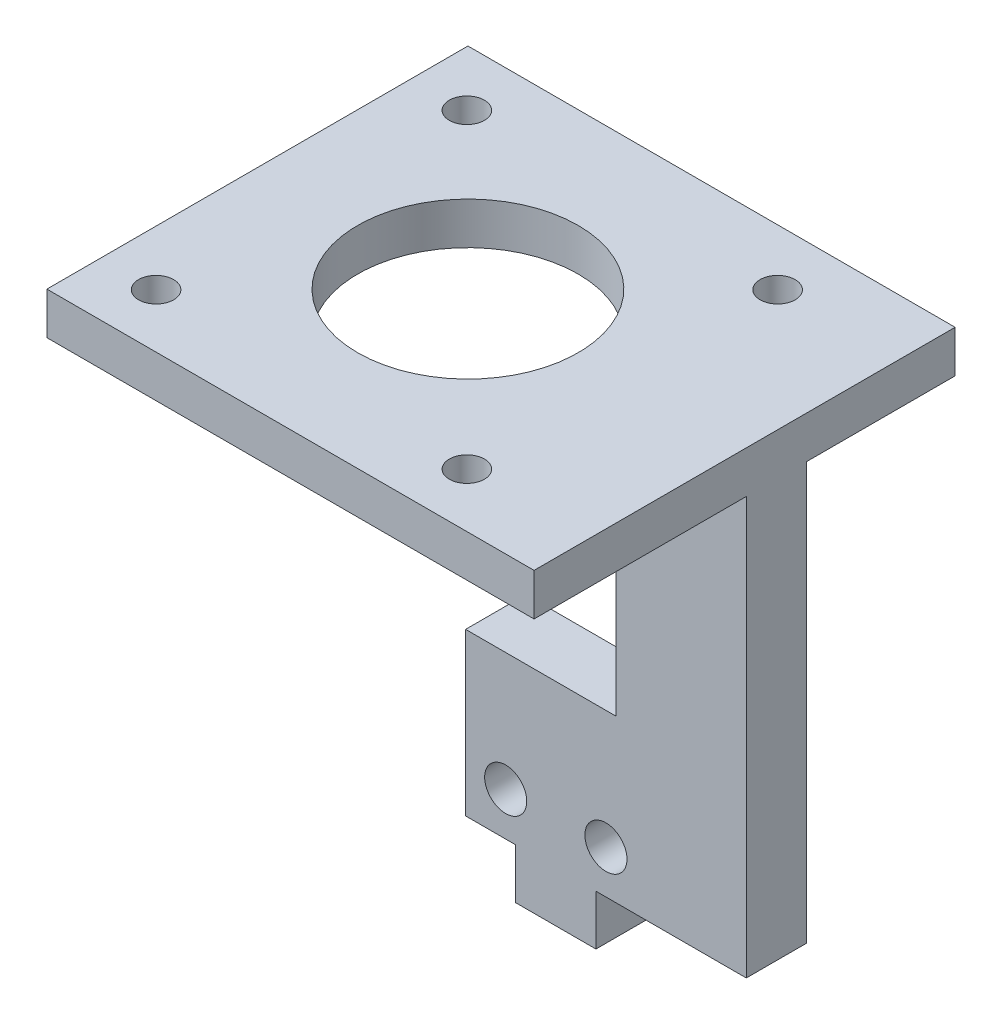
ISO-10303-21;
HEADER;
FILE_DESCRIPTION(('STEP AP214'),'2;1');
FILE_NAME('part.step','',(''),(''),'','','');
FILE_SCHEMA(('AUTOMOTIVE_DESIGN { 1 0 10303 214 1 1 1 1 }'));
ENDSEC;
DATA;
#1=APPLICATION_CONTEXT('core data for automotive mechanical design processes');
#2=APPLICATION_PROTOCOL_DEFINITION('international standard','automotive_design',2000,#1);
#3=PRODUCT_CONTEXT('',#1,'mechanical');
#4=PRODUCT('Part','Part','',(#3));
#5=PRODUCT_RELATED_PRODUCT_CATEGORY('part','',(#4));
#6=PRODUCT_DEFINITION_FORMATION('','',#4);
#7=PRODUCT_DEFINITION_CONTEXT('part definition',#1,'design');
#8=PRODUCT_DEFINITION('design','',#6,#7);
#9=PRODUCT_DEFINITION_SHAPE('','',#8);
#10=(LENGTH_UNIT() NAMED_UNIT(*) SI_UNIT(.MILLI.,.METRE.));
#11=(NAMED_UNIT(*) PLANE_ANGLE_UNIT() SI_UNIT($,.RADIAN.));
#12=(NAMED_UNIT(*) SI_UNIT($,.STERADIAN.) SOLID_ANGLE_UNIT());
#13=UNCERTAINTY_MEASURE_WITH_UNIT(LENGTH_MEASURE(1.E-05),#10,'distance_accuracy_value','');
#14=(GEOMETRIC_REPRESENTATION_CONTEXT(3) GLOBAL_UNCERTAINTY_ASSIGNED_CONTEXT((#13)) GLOBAL_UNIT_ASSIGNED_CONTEXT((#10,
#11,#12)) REPRESENTATION_CONTEXT('',''));
#15=CARTESIAN_POINT('',(0.,0.,0.));
#16=DIRECTION('',(0.,0.,1.));
#17=DIRECTION('',(1.,0.,0.));
#18=AXIS2_PLACEMENT_3D('',#15,#16,#17);
#19=CARTESIAN_POINT('',(0.,0.,6.));
#20=DIRECTION('',(0.,0.,-1.));
#21=DIRECTION('',(-1.,0.,0.));
#22=AXIS2_PLACEMENT_3D('',#19,#20,#21);
#23=PLANE('',#22);
#24=CARTESIAN_POINT('',(14.,4.30447472,6.));
#25=DIRECTION('',(0.,0.,1.));
#26=DIRECTION('',(-1.,0.,0.));
#27=AXIS2_PLACEMENT_3D('',#24,#25,#26);
#28=CIRCLE('',#27,2.1);
#29=CARTESIAN_POINT('',(11.9,4.30447472,6.));
#30=VERTEX_POINT('',#29);
#31=EDGE_CURVE('E229',#30,#30,#28,.T.);
#32=ORIENTED_EDGE('',*,*,#31,.F.);
#33=EDGE_LOOP('',(#32));
#34=FACE_BOUND('',#33,.T.);
#35=CARTESIAN_POINT('',(4.,4.30447472,6.));
#36=DIRECTION('',(0.,0.,1.));
#37=DIRECTION('',(1.,0.,0.));
#38=AXIS2_PLACEMENT_3D('',#35,#36,#37);
#39=CIRCLE('',#38,2.1);
#40=CARTESIAN_POINT('',(6.1,4.30447472,6.));
#41=VERTEX_POINT('',#40);
#42=EDGE_CURVE('E233',#41,#41,#39,.T.);
#43=ORIENTED_EDGE('',*,*,#42,.F.);
#44=EDGE_LOOP('',(#43));
#45=FACE_BOUND('',#44,.T.);
#46=DIRECTION('',(1.,0.,0.));
#47=VECTOR('',#46,1.);
#48=CARTESIAN_POINT('',(0.,41.6,6.));
#49=LINE('',#48,#47);
#50=CARTESIAN_POINT('',(15.,41.6,6.));
#51=VERTEX_POINT('',#50);
#52=CARTESIAN_POINT('',(28.,41.6,6.));
#53=VERTEX_POINT('',#52);
#54=EDGE_CURVE('E176',#51,#53,#49,.T.);
#55=ORIENTED_EDGE('',*,*,#54,.F.);
#56=DIRECTION('',(0.,1.,0.));
#57=VECTOR('',#56,1.);
#58=CARTESIAN_POINT('',(15.,16.1193661254941,6.));
#59=LINE('',#58,#57);
#60=CARTESIAN_POINT('',(15.,16.1193661254941,6.));
#61=VERTEX_POINT('',#60);
#62=EDGE_CURVE('E183',#61,#51,#59,.T.);
#63=ORIENTED_EDGE('',*,*,#62,.F.);
#64=DIRECTION('',(1.,0.,0.));
#65=VECTOR('',#64,1.);
#66=CARTESIAN_POINT('',(0.,16.1193661254941,6.));
#67=LINE('',#66,#65);
#68=CARTESIAN_POINT('',(0.,16.1193661254941,6.));
#69=VERTEX_POINT('',#68);
#70=EDGE_CURVE('E180',#69,#61,#67,.T.);
#71=ORIENTED_EDGE('',*,*,#70,.F.);
#72=DIRECTION('',(0.,-1.,0.));
#73=VECTOR('',#72,1.);
#74=CARTESIAN_POINT('',(0.,0.,6.));
#75=LINE('',#74,#73);
#76=CARTESIAN_POINT('',(0.,0.,6.));
#77=VERTEX_POINT('',#76);
#78=EDGE_CURVE('E242',#69,#77,#75,.T.);
#79=ORIENTED_EDGE('',*,*,#78,.T.);
#80=DIRECTION('',(1.,0.,0.));
#81=VECTOR('',#80,1.);
#82=CARTESIAN_POINT('',(0.,0.,6.));
#83=LINE('',#82,#81);
#84=CARTESIAN_POINT('',(5.,0.,6.));
#85=VERTEX_POINT('',#84);
#86=EDGE_CURVE('E246',#77,#85,#83,.T.);
#87=ORIENTED_EDGE('',*,*,#86,.T.);
#88=DIRECTION('',(0.,1.,0.));
#89=VECTOR('',#88,1.);
#90=CARTESIAN_POINT('',(5.,-5.,6.));
#91=LINE('',#90,#89);
#92=CARTESIAN_POINT('',(5.,-5.,6.));
#93=VERTEX_POINT('',#92);
#94=EDGE_CURVE('E223',#93,#85,#91,.T.);
#95=ORIENTED_EDGE('',*,*,#94,.F.);
#96=DIRECTION('',(-1.,0.,0.));
#97=VECTOR('',#96,1.);
#98=CARTESIAN_POINT('',(13.,-5.,6.));
#99=LINE('',#98,#97);
#100=CARTESIAN_POINT('',(13.,-5.,6.));
#101=VERTEX_POINT('',#100);
#102=EDGE_CURVE('E202',#101,#93,#99,.T.);
#103=ORIENTED_EDGE('',*,*,#102,.F.);
#104=DIRECTION('',(0.,1.,0.));
#105=VECTOR('',#104,1.);
#106=CARTESIAN_POINT('',(13.,-5.,6.));
#107=LINE('',#106,#105);
#108=CARTESIAN_POINT('',(13.,0.,6.));
#109=VERTEX_POINT('',#108);
#110=EDGE_CURVE('E226',#101,#109,#107,.T.);
#111=ORIENTED_EDGE('',*,*,#110,.T.);
#112=CARTESIAN_POINT('',(28.,0.,6.));
#113=VERTEX_POINT('',#112);
#114=EDGE_CURVE('E244',#109,#113,#83,.T.);
#115=ORIENTED_EDGE('',*,*,#114,.T.);
#116=DIRECTION('',(0.,-1.,0.));
#117=VECTOR('',#116,1.);
#118=CARTESIAN_POINT('',(28.,0.,6.));
#119=LINE('',#118,#117);
#120=EDGE_CURVE('E193',#53,#113,#119,.T.);
#121=ORIENTED_EDGE('',*,*,#120,.F.);
#122=EDGE_LOOP('',(#55,#63,#71,#79,#87,#95,#103,#111,#115,#121));
#123=FACE_BOUND('',#122,.T.);
#124=ADVANCED_FACE('F35',(#34,#45,#123),#23,.F.);
#125=CARTESIAN_POINT('',(0.,0.,0.));
#126=DIRECTION('',(0.,0.,-1.));
#127=DIRECTION('',(-1.,0.,0.));
#128=AXIS2_PLACEMENT_3D('',#125,#126,#127);
#129=PLANE('',#128);
#130=CARTESIAN_POINT('',(14.,4.30447472,0.));
#131=DIRECTION('',(0.,0.,1.));
#132=DIRECTION('',(-1.,0.,0.));
#133=AXIS2_PLACEMENT_3D('',#130,#131,#132);
#134=CIRCLE('',#133,2.1);
#135=CARTESIAN_POINT('',(11.9,4.30447472,0.));
#136=VERTEX_POINT('',#135);
#137=EDGE_CURVE('E230',#136,#136,#134,.T.);
#138=ORIENTED_EDGE('',*,*,#137,.T.);
#139=EDGE_LOOP('',(#138));
#140=FACE_BOUND('',#139,.T.);
#141=CARTESIAN_POINT('',(4.,4.30447472,0.));
#142=DIRECTION('',(0.,0.,1.));
#143=DIRECTION('',(1.,0.,0.));
#144=AXIS2_PLACEMENT_3D('',#141,#142,#143);
#145=CIRCLE('',#144,2.1);
#146=CARTESIAN_POINT('',(6.1,4.30447472,0.));
#147=VERTEX_POINT('',#146);
#148=EDGE_CURVE('E236',#147,#147,#145,.T.);
#149=ORIENTED_EDGE('',*,*,#148,.T.);
#150=EDGE_LOOP('',(#149));
#151=FACE_BOUND('',#150,.T.);
#152=DIRECTION('',(0.,-1.,0.));
#153=VECTOR('',#152,1.);
#154=CARTESIAN_POINT('',(15.,0.,0.));
#155=LINE('',#154,#153);
#156=CARTESIAN_POINT('',(15.,41.6,0.));
#157=VERTEX_POINT('',#156);
#158=CARTESIAN_POINT('',(15.,16.1193661254941,0.));
#159=VERTEX_POINT('',#158);
#160=EDGE_CURVE('E57',#157,#159,#155,.T.);
#161=ORIENTED_EDGE('',*,*,#160,.F.);
#162=DIRECTION('',(1.,0.,0.));
#163=VECTOR('',#162,1.);
#164=CARTESIAN_POINT('',(0.,41.6,0.));
#165=LINE('',#164,#163);
#166=CARTESIAN_POINT('',(28.,41.6,0.));
#167=VERTEX_POINT('',#166);
#168=EDGE_CURVE('E169',#157,#167,#165,.T.);
#169=ORIENTED_EDGE('',*,*,#168,.T.);
#170=DIRECTION('',(0.,1.,0.));
#171=VECTOR('',#170,1.);
#172=CARTESIAN_POINT('',(28.,0.,0.));
#173=LINE('',#172,#171);
#174=CARTESIAN_POINT('',(28.,0.,0.));
#175=VERTEX_POINT('',#174);
#176=EDGE_CURVE('E189',#175,#167,#173,.T.);
#177=ORIENTED_EDGE('',*,*,#176,.F.);
#178=DIRECTION('',(1.,0.,0.));
#179=VECTOR('',#178,1.);
#180=CARTESIAN_POINT('',(0.,0.,0.));
#181=LINE('',#180,#179);
#182=CARTESIAN_POINT('',(13.,0.,0.));
#183=VERTEX_POINT('',#182);
#184=EDGE_CURVE('E251',#183,#175,#181,.T.);
#185=ORIENTED_EDGE('',*,*,#184,.F.);
#186=CARTESIAN_POINT('',(5.,0.,0.));
#187=VERTEX_POINT('',#186);
#188=EDGE_CURVE('E253',#187,#183,#181,.T.);
#189=ORIENTED_EDGE('',*,*,#188,.F.);
#190=CARTESIAN_POINT('',(0.,0.,0.));
#191=VERTEX_POINT('',#190);
#192=EDGE_CURVE('E245',#191,#187,#181,.T.);
#193=ORIENTED_EDGE('',*,*,#192,.F.);
#194=DIRECTION('',(0.,-1.,0.));
#195=VECTOR('',#194,1.);
#196=CARTESIAN_POINT('',(0.,0.,0.));
#197=LINE('',#196,#195);
#198=CARTESIAN_POINT('',(0.,16.1193661254941,0.));
#199=VERTEX_POINT('',#198);
#200=EDGE_CURVE('E239',#199,#191,#197,.T.);
#201=ORIENTED_EDGE('',*,*,#200,.F.);
#202=DIRECTION('',(-1.,0.,0.));
#203=VECTOR('',#202,1.);
#204=CARTESIAN_POINT('',(0.,16.1193661254941,0.));
#205=LINE('',#204,#203);
#206=EDGE_CURVE('E256',#159,#199,#205,.T.);
#207=ORIENTED_EDGE('',*,*,#206,.F.);
#208=EDGE_LOOP('',(#161,#169,#177,#185,#189,#193,#201,#207));
#209=FACE_BOUND('',#208,.T.);
#210=ADVANCED_FACE('F304',(#140,#151,#209),#129,.T.);
#211=CARTESIAN_POINT('',(15.,16.1193661254941,-4.));
#212=DIRECTION('',(1.,0.,0.));
#213=DIRECTION('',(0.,0.,-1.));
#214=AXIS2_PLACEMENT_3D('',#211,#212,#213);
#215=PLANE('',#214);
#216=DIRECTION('',(0.,0.,1.));
#217=VECTOR('',#216,1.);
#218=CARTESIAN_POINT('',(15.,41.6,-4.));
#219=LINE('',#218,#217);
#220=EDGE_CURVE('E43',#157,#51,#219,.T.);
#221=ORIENTED_EDGE('',*,*,#220,.F.);
#222=ORIENTED_EDGE('',*,*,#160,.T.);
#223=DIRECTION('',(0.,0.,1.));
#224=VECTOR('',#223,1.);
#225=CARTESIAN_POINT('',(15.,16.1193661254941,-4.));
#226=LINE('',#225,#224);
#227=EDGE_CURVE('E187',#159,#61,#226,.T.);
#228=ORIENTED_EDGE('',*,*,#227,.T.);
#229=ORIENTED_EDGE('',*,*,#62,.T.);
#230=EDGE_LOOP('',(#221,#222,#228,#229));
#231=FACE_BOUND('',#230,.T.);
#232=ADVANCED_FACE('F268',(#231),#215,.F.);
#233=CARTESIAN_POINT('',(28.,0.,0.));
#234=DIRECTION('',(1.,0.,0.));
#235=DIRECTION('',(0.,1.,0.));
#236=AXIS2_PLACEMENT_3D('',#233,#234,#235);
#237=PLANE('',#236);
#238=DIRECTION('',(0.,0.,-1.));
#239=VECTOR('',#238,1.);
#240=CARTESIAN_POINT('',(28.,45.8,6.));
#241=LINE('',#240,#239);
#242=CARTESIAN_POINT('',(28.,45.8,27.17));
#243=VERTEX_POINT('',#242);
#244=CARTESIAN_POINT('',(28.,45.8,-14.83));
#245=VERTEX_POINT('',#244);
#246=EDGE_CURVE('E178',#243,#245,#241,.T.);
#247=ORIENTED_EDGE('',*,*,#246,.F.);
#248=DIRECTION('',(0.,1.,0.));
#249=VECTOR('',#248,1.);
#250=CARTESIAN_POINT('',(28.,41.6,27.17));
#251=LINE('',#250,#249);
#252=CARTESIAN_POINT('',(28.,41.6,27.17));
#253=VERTEX_POINT('',#252);
#254=EDGE_CURVE('E160',#253,#243,#251,.T.);
#255=ORIENTED_EDGE('',*,*,#254,.F.);
#256=DIRECTION('',(0.,0.,-1.));
#257=VECTOR('',#256,1.);
#258=CARTESIAN_POINT('',(28.,41.6,27.17));
#259=LINE('',#258,#257);
#260=EDGE_CURVE('E163',#253,#53,#259,.T.);
#261=ORIENTED_EDGE('',*,*,#260,.T.);
#262=ORIENTED_EDGE('',*,*,#120,.T.);
#263=DIRECTION('',(0.,0.,-1.));
#264=VECTOR('',#263,1.);
#265=CARTESIAN_POINT('',(28.,0.,0.));
#266=LINE('',#265,#264);
#267=EDGE_CURVE('E195',#113,#175,#266,.T.);
#268=ORIENTED_EDGE('',*,*,#267,.T.);
#269=ORIENTED_EDGE('',*,*,#176,.T.);
#270=CARTESIAN_POINT('',(28.,41.6,-14.83));
#271=VERTEX_POINT('',#270);
#272=EDGE_CURVE('E161',#167,#271,#259,.T.);
#273=ORIENTED_EDGE('',*,*,#272,.T.);
#274=DIRECTION('',(0.,1.,0.));
#275=VECTOR('',#274,1.);
#276=CARTESIAN_POINT('',(28.,41.6,-14.83));
#277=LINE('',#276,#275);
#278=EDGE_CURVE('E170',#271,#245,#277,.T.);
#279=ORIENTED_EDGE('',*,*,#278,.T.);
#280=EDGE_LOOP('',(#247,#255,#261,#262,#268,#269,#273,#279));
#281=FACE_BOUND('',#280,.T.);
#282=ADVANCED_FACE('F334',(#281),#237,.T.);
#283=CARTESIAN_POINT('',(0.,0.,6.));
#284=DIRECTION('',(0.,1.,0.));
#285=DIRECTION('',(0.,0.,1.));
#286=AXIS2_PLACEMENT_3D('',#283,#284,#285);
#287=PLANE('',#286);
#288=DIRECTION('',(0.,0.,1.));
#289=VECTOR('',#288,1.);
#290=CARTESIAN_POINT('',(13.,0.,6.));
#291=LINE('',#290,#289);
#292=EDGE_CURVE('E213',#183,#109,#291,.T.);
#293=ORIENTED_EDGE('',*,*,#292,.F.);
#294=ORIENTED_EDGE('',*,*,#184,.T.);
#295=ORIENTED_EDGE('',*,*,#267,.F.);
#296=ORIENTED_EDGE('',*,*,#114,.F.);
#297=EDGE_LOOP('',(#293,#294,#295,#296));
#298=FACE_BOUND('',#297,.T.);
#299=ADVANCED_FACE('F300',(#298),#287,.F.);
#300=DIRECTION('',(0.,0.,-1.));
#301=VECTOR('',#300,1.);
#302=CARTESIAN_POINT('',(5.,0.,6.));
#303=LINE('',#302,#301);
#304=EDGE_CURVE('E214',#85,#187,#303,.T.);
#305=ORIENTED_EDGE('',*,*,#304,.F.);
#306=ORIENTED_EDGE('',*,*,#86,.F.);
#307=DIRECTION('',(0.,0.,-1.));
#308=VECTOR('',#307,1.);
#309=CARTESIAN_POINT('',(0.,0.,6.));
#310=LINE('',#309,#308);
#311=EDGE_CURVE('E249',#77,#191,#310,.T.);
#312=ORIENTED_EDGE('',*,*,#311,.T.);
#313=ORIENTED_EDGE('',*,*,#192,.T.);
#314=EDGE_LOOP('',(#305,#306,#312,#313));
#315=FACE_BOUND('',#314,.T.);
#316=ADVANCED_FACE('F280',(#315),#287,.F.);
#317=CARTESIAN_POINT('',(0.,0.,6.));
#318=DIRECTION('',(1.,0.,0.));
#319=DIRECTION('',(0.,1.,0.));
#320=AXIS2_PLACEMENT_3D('',#317,#318,#319);
#321=PLANE('',#320);
#322=ORIENTED_EDGE('',*,*,#78,.F.);
#323=DIRECTION('',(0.,0.,1.));
#324=VECTOR('',#323,1.);
#325=CARTESIAN_POINT('',(0.,16.1193661254941,-4.));
#326=LINE('',#325,#324);
#327=EDGE_CURVE('E186',#199,#69,#326,.T.);
#328=ORIENTED_EDGE('',*,*,#327,.F.);
#329=ORIENTED_EDGE('',*,*,#200,.T.);
#330=ORIENTED_EDGE('',*,*,#311,.F.);
#331=EDGE_LOOP('',(#322,#328,#329,#330));
#332=FACE_BOUND('',#331,.T.);
#333=ADVANCED_FACE('F37',(#332),#321,.F.);
#334=CARTESIAN_POINT('',(4.,4.30447472,0.));
#335=DIRECTION('',(0.,0.,1.));
#336=DIRECTION('',(1.,0.,0.));
#337=AXIS2_PLACEMENT_3D('',#334,#335,#336);
#338=CYLINDRICAL_SURFACE('',#337,2.1);
#339=ORIENTED_EDGE('',*,*,#148,.F.);
#340=EDGE_LOOP('',(#339));
#341=FACE_BOUND('',#340,.T.);
#342=ORIENTED_EDGE('',*,*,#42,.T.);
#343=EDGE_LOOP('',(#342));
#344=FACE_BOUND('',#343,.T.);
#345=ADVANCED_FACE('F331',(#341,#344),#338,.F.);
#346=CARTESIAN_POINT('',(14.,4.30447472,0.));
#347=DIRECTION('',(0.,0.,1.));
#348=DIRECTION('',(1.,0.,0.));
#349=AXIS2_PLACEMENT_3D('',#346,#347,#348);
#350=CYLINDRICAL_SURFACE('',#349,2.1);
#351=ORIENTED_EDGE('',*,*,#137,.F.);
#352=EDGE_LOOP('',(#351));
#353=FACE_BOUND('',#352,.T.);
#354=ORIENTED_EDGE('',*,*,#31,.T.);
#355=EDGE_LOOP('',(#354));
#356=FACE_BOUND('',#355,.T.);
#357=ADVANCED_FACE('F566',(#353,#356),#350,.F.);
#358=CARTESIAN_POINT('',(13.,-5.,6.));
#359=DIRECTION('',(-1.,0.,0.));
#360=DIRECTION('',(0.,0.,1.));
#361=AXIS2_PLACEMENT_3D('',#358,#359,#360);
#362=PLANE('',#361);
#363=CARTESIAN_POINT('',(13.,0.,-4.));
#364=VERTEX_POINT('',#363);
#365=EDGE_CURVE('E198',#364,#183,#291,.T.);
#366=ORIENTED_EDGE('',*,*,#365,.T.);
#367=ORIENTED_EDGE('',*,*,#292,.T.);
#368=ORIENTED_EDGE('',*,*,#110,.F.);
#369=DIRECTION('',(0.,0.,1.));
#370=VECTOR('',#369,1.);
#371=CARTESIAN_POINT('',(13.,-5.,6.));
#372=LINE('',#371,#370);
#373=CARTESIAN_POINT('',(13.,-5.,-4.));
#374=VERTEX_POINT('',#373);
#375=EDGE_CURVE('E199',#374,#101,#372,.T.);
#376=ORIENTED_EDGE('',*,*,#375,.F.);
#377=DIRECTION('',(0.,1.,0.));
#378=VECTOR('',#377,1.);
#379=CARTESIAN_POINT('',(13.,-5.,-4.));
#380=LINE('',#379,#378);
#381=EDGE_CURVE('E209',#374,#364,#380,.T.);
#382=ORIENTED_EDGE('',*,*,#381,.T.);
#383=EDGE_LOOP('',(#366,#367,#368,#376,#382));
#384=FACE_BOUND('',#383,.T.);
#385=ADVANCED_FACE('F296',(#384),#362,.F.);
#386=CARTESIAN_POINT('',(5.,-5.,6.));
#387=DIRECTION('',(1.,0.,0.));
#388=DIRECTION('',(0.,0.,-1.));
#389=AXIS2_PLACEMENT_3D('',#386,#387,#388);
#390=PLANE('',#389);
#391=ORIENTED_EDGE('',*,*,#304,.T.);
#392=CARTESIAN_POINT('',(5.,0.,-4.));
#393=VERTEX_POINT('',#392);
#394=EDGE_CURVE('E212',#187,#393,#303,.T.);
#395=ORIENTED_EDGE('',*,*,#394,.T.);
#396=DIRECTION('',(0.,1.,0.));
#397=VECTOR('',#396,1.);
#398=CARTESIAN_POINT('',(5.,-5.,-4.));
#399=LINE('',#398,#397);
#400=CARTESIAN_POINT('',(5.,-5.,-4.));
#401=VERTEX_POINT('',#400);
#402=EDGE_CURVE('E220',#401,#393,#399,.T.);
#403=ORIENTED_EDGE('',*,*,#402,.F.);
#404=DIRECTION('',(0.,0.,-1.));
#405=VECTOR('',#404,1.);
#406=CARTESIAN_POINT('',(5.,-5.,6.));
#407=LINE('',#406,#405);
#408=EDGE_CURVE('E205',#93,#401,#407,.T.);
#409=ORIENTED_EDGE('',*,*,#408,.F.);
#410=ORIENTED_EDGE('',*,*,#94,.T.);
#411=EDGE_LOOP('',(#391,#395,#403,#409,#410));
#412=FACE_BOUND('',#411,.T.);
#413=ADVANCED_FACE('F285',(#412),#390,.F.);
#414=CARTESIAN_POINT('',(13.,-5.,-4.));
#415=DIRECTION('',(0.,0.,1.));
#416=DIRECTION('',(1.,0.,0.));
#417=AXIS2_PLACEMENT_3D('',#414,#415,#416);
#418=PLANE('',#417);
#419=DIRECTION('',(1.,0.,0.));
#420=VECTOR('',#419,1.);
#421=CARTESIAN_POINT('',(13.,0.,-4.));
#422=LINE('',#421,#420);
#423=EDGE_CURVE('E203',#393,#364,#422,.T.);
#424=ORIENTED_EDGE('',*,*,#423,.T.);
#425=ORIENTED_EDGE('',*,*,#381,.F.);
#426=DIRECTION('',(1.,0.,0.));
#427=VECTOR('',#426,1.);
#428=CARTESIAN_POINT('',(13.,-5.,-4.));
#429=LINE('',#428,#427);
#430=EDGE_CURVE('E207',#401,#374,#429,.T.);
#431=ORIENTED_EDGE('',*,*,#430,.F.);
#432=ORIENTED_EDGE('',*,*,#402,.T.);
#433=EDGE_LOOP('',(#424,#425,#431,#432));
#434=FACE_BOUND('',#433,.T.);
#435=ADVANCED_FACE('F310',(#434),#418,.F.);
#436=CARTESIAN_POINT('',(0.,-5.,0.));
#437=DIRECTION('',(0.,1.,0.));
#438=DIRECTION('',(0.,0.,1.));
#439=AXIS2_PLACEMENT_3D('',#436,#437,#438);
#440=PLANE('',#439);
#441=ORIENTED_EDGE('',*,*,#375,.T.);
#442=ORIENTED_EDGE('',*,*,#102,.T.);
#443=ORIENTED_EDGE('',*,*,#408,.T.);
#444=ORIENTED_EDGE('',*,*,#430,.T.);
#445=EDGE_LOOP('',(#441,#442,#443,#444));
#446=FACE_BOUND('',#445,.T.);
#447=ADVANCED_FACE('F289',(#446),#440,.F.);
#448=CARTESIAN_POINT('',(0.,0.,0.));
#449=DIRECTION('',(0.,1.,0.));
#450=DIRECTION('',(0.,0.,1.));
#451=AXIS2_PLACEMENT_3D('',#448,#449,#450);
#452=PLANE('',#451);
#453=ORIENTED_EDGE('',*,*,#394,.F.);
#454=ORIENTED_EDGE('',*,*,#188,.T.);
#455=ORIENTED_EDGE('',*,*,#365,.F.);
#456=ORIENTED_EDGE('',*,*,#423,.F.);
#457=EDGE_LOOP('',(#453,#454,#455,#456));
#458=FACE_BOUND('',#457,.T.);
#459=ADVANCED_FACE('F307',(#458),#452,.T.);
#460=CARTESIAN_POINT('',(0.,16.1193661254941,-4.));
#461=DIRECTION('',(0.,-1.,0.));
#462=DIRECTION('',(0.,0.,-1.));
#463=AXIS2_PLACEMENT_3D('',#460,#461,#462);
#464=PLANE('',#463);
#465=ORIENTED_EDGE('',*,*,#206,.T.);
#466=ORIENTED_EDGE('',*,*,#327,.T.);
#467=ORIENTED_EDGE('',*,*,#70,.T.);
#468=ORIENTED_EDGE('',*,*,#227,.F.);
#469=EDGE_LOOP('',(#465,#466,#467,#468));
#470=FACE_BOUND('',#469,.T.);
#471=ADVANCED_FACE('F271',(#470),#464,.F.);
#472=CARTESIAN_POINT('',(0.,45.8,0.));
#473=DIRECTION('',(0.,1.,0.));
#474=DIRECTION('',(0.,0.,1.));
#475=AXIS2_PLACEMENT_3D('',#472,#473,#474);
#476=PLANE('',#475);
#477=CARTESIAN_POINT('',(0.399999999995969,45.8,6.17000000000101));
#478=DIRECTION('',(0.,1.,0.));
#479=DIRECTION('',(0.,0.,1.));
#480=AXIS2_PLACEMENT_3D('',#477,#478,#479);
#481=CIRCLE('',#480,11.);
#482=CARTESIAN_POINT('',(0.399999999995969,45.8,17.170000000001));
#483=VERTEX_POINT('',#482);
#484=EDGE_CURVE('E395',#483,#483,#481,.T.);
#485=ORIENTED_EDGE('',*,*,#484,.F.);
#486=EDGE_LOOP('',(#485));
#487=FACE_BOUND('',#486,.T.);
#488=CARTESIAN_POINT('',(-15.09762783,45.8,-9.22379542));
#489=DIRECTION('',(0.,1.,0.));
#490=DIRECTION('',(0.,0.,1.));
#491=AXIS2_PLACEMENT_3D('',#488,#489,#490);
#492=CIRCLE('',#491,1.75);
#493=CARTESIAN_POINT('',(-15.09762783,45.8,-7.47379542));
#494=VERTEX_POINT('',#493);
#495=EDGE_CURVE('E417',#494,#494,#492,.T.);
#496=ORIENTED_EDGE('',*,*,#495,.F.);
#497=EDGE_LOOP('',(#496));
#498=FACE_BOUND('',#497,.T.);
#499=CARTESIAN_POINT('',(15.90237217,45.8,21.77620458));
#500=DIRECTION('',(0.,1.,0.));
#501=DIRECTION('',(0.,0.,1.));
#502=AXIS2_PLACEMENT_3D('',#499,#500,#501);
#503=CIRCLE('',#502,1.75);
#504=CARTESIAN_POINT('',(15.90237217,45.8,23.52620458));
#505=VERTEX_POINT('',#504);
#506=EDGE_CURVE('E414',#505,#505,#503,.T.);
#507=ORIENTED_EDGE('',*,*,#506,.F.);
#508=EDGE_LOOP('',(#507));
#509=FACE_BOUND('',#508,.T.);
#510=CARTESIAN_POINT('',(-15.09762783,45.8,21.77620458));
#511=DIRECTION('',(0.,1.,0.));
#512=DIRECTION('',(0.,0.,1.));
#513=AXIS2_PLACEMENT_3D('',#510,#511,#512);
#514=CIRCLE('',#513,1.75);
#515=CARTESIAN_POINT('',(-15.09762783,45.8,23.52620458));
#516=VERTEX_POINT('',#515);
#517=EDGE_CURVE('E406',#516,#516,#514,.T.);
#518=ORIENTED_EDGE('',*,*,#517,.F.);
#519=EDGE_LOOP('',(#518));
#520=FACE_BOUND('',#519,.T.);
#521=CARTESIAN_POINT('',(15.90237217,45.8,-9.22379542));
#522=DIRECTION('',(0.,1.,0.));
#523=DIRECTION('',(0.,0.,1.));
#524=AXIS2_PLACEMENT_3D('',#521,#522,#523);
#525=CIRCLE('',#524,1.75);
#526=CARTESIAN_POINT('',(15.90237217,45.8,-7.47379542));
#527=VERTEX_POINT('',#526);
#528=EDGE_CURVE('E147',#527,#527,#525,.T.);
#529=ORIENTED_EDGE('',*,*,#528,.F.);
#530=EDGE_LOOP('',(#529));
#531=FACE_BOUND('',#530,.T.);
#532=DIRECTION('',(0.,0.,-1.));
#533=VECTOR('',#532,1.);
#534=CARTESIAN_POINT('',(-20.597266504442,45.8,27.17));
#535=LINE('',#534,#533);
#536=CARTESIAN_POINT('',(-20.597266504442,45.8,27.17));
#537=VERTEX_POINT('',#536);
#538=CARTESIAN_POINT('',(-20.597266504442,45.8,-14.83));
#539=VERTEX_POINT('',#538);
#540=EDGE_CURVE('E49',#537,#539,#535,.T.);
#541=ORIENTED_EDGE('',*,*,#540,.F.);
#542=DIRECTION('',(1.,0.,0.));
#543=VECTOR('',#542,1.);
#544=CARTESIAN_POINT('',(28.,45.8,27.17));
#545=LINE('',#544,#543);
#546=EDGE_CURVE('E152',#537,#243,#545,.T.);
#547=ORIENTED_EDGE('',*,*,#546,.T.);
#548=ORIENTED_EDGE('',*,*,#246,.T.);
#549=DIRECTION('',(-1.,0.,0.));
#550=VECTOR('',#549,1.);
#551=CARTESIAN_POINT('',(28.,45.8,-14.83));
#552=LINE('',#551,#550);
#553=EDGE_CURVE('E155',#245,#539,#552,.T.);
#554=ORIENTED_EDGE('',*,*,#553,.T.);
#555=EDGE_LOOP('',(#541,#547,#548,#554));
#556=FACE_BOUND('',#555,.T.);
#557=ADVANCED_FACE('F151',(#487,#498,#509,#520,#531,#556),#476,.T.);
#558=CARTESIAN_POINT('',(0.,41.6,0.));
#559=DIRECTION('',(0.,1.,0.));
#560=DIRECTION('',(0.,0.,1.));
#561=AXIS2_PLACEMENT_3D('',#558,#559,#560);
#562=PLANE('',#561);
#563=CARTESIAN_POINT('',(0.399999999995969,41.6,6.17000000000101));
#564=DIRECTION('',(0.,-1.,0.));
#565=DIRECTION('',(0.,0.,-1.));
#566=AXIS2_PLACEMENT_3D('',#563,#564,#565);
#567=CIRCLE('',#566,11.);
#568=CARTESIAN_POINT('',(0.399999999995969,41.6,-4.82999999999899));
#569=VERTEX_POINT('',#568);
#570=EDGE_CURVE('E398',#569,#569,#567,.T.);
#571=ORIENTED_EDGE('',*,*,#570,.F.);
#572=EDGE_LOOP('',(#571));
#573=FACE_BOUND('',#572,.T.);
#574=CARTESIAN_POINT('',(-15.09762783,41.6,-9.22379542));
#575=DIRECTION('',(0.,-1.,0.));
#576=DIRECTION('',(0.,0.,1.));
#577=AXIS2_PLACEMENT_3D('',#574,#575,#576);
#578=CIRCLE('',#577,1.75);
#579=CARTESIAN_POINT('',(-15.09762783,41.6,-7.47379542));
#580=VERTEX_POINT('',#579);
#581=EDGE_CURVE('E403',#580,#580,#578,.T.);
#582=ORIENTED_EDGE('',*,*,#581,.F.);
#583=EDGE_LOOP('',(#582));
#584=FACE_BOUND('',#583,.T.);
#585=CARTESIAN_POINT('',(15.90237217,41.6,21.77620458));
#586=DIRECTION('',(0.,-1.,0.));
#587=DIRECTION('',(0.,0.,1.));
#588=AXIS2_PLACEMENT_3D('',#585,#586,#587);
#589=CIRCLE('',#588,1.75);
#590=CARTESIAN_POINT('',(15.90237217,41.6,23.52620458));
#591=VERTEX_POINT('',#590);
#592=EDGE_CURVE('E407',#591,#591,#589,.T.);
#593=ORIENTED_EDGE('',*,*,#592,.F.);
#594=EDGE_LOOP('',(#593));
#595=FACE_BOUND('',#594,.T.);
#596=CARTESIAN_POINT('',(-15.09762783,41.6,21.77620458));
#597=DIRECTION('',(0.,-1.,0.));
#598=DIRECTION('',(0.,0.,-1.));
#599=AXIS2_PLACEMENT_3D('',#596,#597,#598);
#600=CIRCLE('',#599,1.75);
#601=CARTESIAN_POINT('',(-15.09762783,41.6,20.02620458));
#602=VERTEX_POINT('',#601);
#603=EDGE_CURVE('E400',#602,#602,#600,.T.);
#604=ORIENTED_EDGE('',*,*,#603,.F.);
#605=EDGE_LOOP('',(#604));
#606=FACE_BOUND('',#605,.T.);
#607=CARTESIAN_POINT('',(15.90237217,41.6,-9.22379542));
#608=DIRECTION('',(0.,-1.,0.));
#609=DIRECTION('',(0.,0.,-1.));
#610=AXIS2_PLACEMENT_3D('',#607,#608,#609);
#611=CIRCLE('',#610,1.75);
#612=CARTESIAN_POINT('',(15.90237217,41.6,-10.97379542));
#613=VERTEX_POINT('',#612);
#614=EDGE_CURVE('E420',#613,#613,#611,.T.);
#615=ORIENTED_EDGE('',*,*,#614,.F.);
#616=EDGE_LOOP('',(#615));
#617=FACE_BOUND('',#616,.T.);
#618=DIRECTION('',(1.,0.,0.));
#619=VECTOR('',#618,1.);
#620=CARTESIAN_POINT('',(28.,41.6,27.17));
#621=LINE('',#620,#619);
#622=CARTESIAN_POINT('',(-20.597266504442,41.6,27.17));
#623=VERTEX_POINT('',#622);
#624=EDGE_CURVE('E173',#623,#253,#621,.T.);
#625=ORIENTED_EDGE('',*,*,#624,.F.);
#626=DIRECTION('',(0.,0.,-1.));
#627=VECTOR('',#626,1.);
#628=CARTESIAN_POINT('',(-20.597266504442,41.6,0.));
#629=LINE('',#628,#627);
#630=CARTESIAN_POINT('',(-20.597266504442,41.6,-14.83));
#631=VERTEX_POINT('',#630);
#632=EDGE_CURVE('E143',#623,#631,#629,.T.);
#633=ORIENTED_EDGE('',*,*,#632,.T.);
#634=DIRECTION('',(-1.,0.,0.));
#635=VECTOR('',#634,1.);
#636=CARTESIAN_POINT('',(28.,41.6,-14.83));
#637=LINE('',#636,#635);
#638=EDGE_CURVE('E426',#271,#631,#637,.T.);
#639=ORIENTED_EDGE('',*,*,#638,.F.);
#640=ORIENTED_EDGE('',*,*,#272,.F.);
#641=ORIENTED_EDGE('',*,*,#168,.F.);
#642=ORIENTED_EDGE('',*,*,#220,.T.);
#643=ORIENTED_EDGE('',*,*,#54,.T.);
#644=ORIENTED_EDGE('',*,*,#260,.F.);
#645=EDGE_LOOP('',(#625,#633,#639,#640,#641,#642,#643,#644));
#646=FACE_BOUND('',#645,.T.);
#647=ADVANCED_FACE('F260',(#573,#584,#595,#606,#617,#646),#562,.F.);
#648=CARTESIAN_POINT('',(28.,41.6,27.17));
#649=DIRECTION('',(0.,0.,1.));
#650=DIRECTION('',(1.,0.,0.));
#651=AXIS2_PLACEMENT_3D('',#648,#649,#650);
#652=PLANE('',#651);
#653=DIRECTION('',(0.,1.,0.));
#654=VECTOR('',#653,1.);
#655=CARTESIAN_POINT('',(-20.597266504442,45.8,27.17));
#656=LINE('',#655,#654);
#657=EDGE_CURVE('E140',#623,#537,#656,.T.);
#658=ORIENTED_EDGE('',*,*,#657,.F.);
#659=ORIENTED_EDGE('',*,*,#624,.T.);
#660=ORIENTED_EDGE('',*,*,#254,.T.);
#661=ORIENTED_EDGE('',*,*,#546,.F.);
#662=EDGE_LOOP('',(#658,#659,#660,#661));
#663=FACE_BOUND('',#662,.T.);
#664=ADVANCED_FACE('F158',(#663),#652,.T.);
#665=CARTESIAN_POINT('',(28.,41.6,-14.83));
#666=DIRECTION('',(0.,0.,-1.));
#667=DIRECTION('',(-1.,0.,0.));
#668=AXIS2_PLACEMENT_3D('',#665,#666,#667);
#669=PLANE('',#668);
#670=DIRECTION('',(0.,-1.,0.));
#671=VECTOR('',#670,1.);
#672=CARTESIAN_POINT('',(-20.597266504442,41.6,-14.83));
#673=LINE('',#672,#671);
#674=EDGE_CURVE('E11',#539,#631,#673,.T.);
#675=ORIENTED_EDGE('',*,*,#674,.F.);
#676=ORIENTED_EDGE('',*,*,#553,.F.);
#677=ORIENTED_EDGE('',*,*,#278,.F.);
#678=ORIENTED_EDGE('',*,*,#638,.T.);
#679=EDGE_LOOP('',(#675,#676,#677,#678));
#680=FACE_BOUND('',#679,.T.);
#681=ADVANCED_FACE('F364',(#680),#669,.T.);
#682=CARTESIAN_POINT('',(-20.597266504442,0.,0.));
#683=DIRECTION('',(1.,0.,0.));
#684=DIRECTION('',(0.,0.,-1.));
#685=AXIS2_PLACEMENT_3D('',#682,#683,#684);
#686=PLANE('',#685);
#687=ORIENTED_EDGE('',*,*,#657,.T.);
#688=ORIENTED_EDGE('',*,*,#540,.T.);
#689=ORIENTED_EDGE('',*,*,#674,.T.);
#690=ORIENTED_EDGE('',*,*,#632,.F.);
#691=EDGE_LOOP('',(#687,#688,#689,#690));
#692=FACE_BOUND('',#691,.T.);
#693=ADVANCED_FACE('F141',(#692),#686,.F.);
#694=CARTESIAN_POINT('',(15.90237217,51.55,-9.22379542));
#695=DIRECTION('',(0.,-1.,0.));
#696=DIRECTION('',(0.,0.,-1.));
#697=AXIS2_PLACEMENT_3D('',#694,#695,#696);
#698=CYLINDRICAL_SURFACE('',#697,1.75);
#699=ORIENTED_EDGE('',*,*,#528,.T.);
#700=EDGE_LOOP('',(#699));
#701=FACE_BOUND('',#700,.T.);
#702=ORIENTED_EDGE('',*,*,#614,.T.);
#703=EDGE_LOOP('',(#702));
#704=FACE_BOUND('',#703,.T.);
#705=ADVANCED_FACE('F372',(#701,#704),#698,.F.);
#706=CARTESIAN_POINT('',(-15.09762783,51.55,21.77620458));
#707=DIRECTION('',(0.,-1.,0.));
#708=DIRECTION('',(0.,0.,-1.));
#709=AXIS2_PLACEMENT_3D('',#706,#707,#708);
#710=CYLINDRICAL_SURFACE('',#709,1.75);
#711=ORIENTED_EDGE('',*,*,#517,.T.);
#712=EDGE_LOOP('',(#711));
#713=FACE_BOUND('',#712,.T.);
#714=ORIENTED_EDGE('',*,*,#603,.T.);
#715=EDGE_LOOP('',(#714));
#716=FACE_BOUND('',#715,.T.);
#717=ADVANCED_FACE('F375',(#713,#716),#710,.F.);
#718=CARTESIAN_POINT('',(15.90237217,51.55,21.77620458));
#719=DIRECTION('',(0.,-1.,0.));
#720=DIRECTION('',(0.,0.,-1.));
#721=AXIS2_PLACEMENT_3D('',#718,#719,#720);
#722=CYLINDRICAL_SURFACE('',#721,1.75);
#723=ORIENTED_EDGE('',*,*,#506,.T.);
#724=EDGE_LOOP('',(#723));
#725=FACE_BOUND('',#724,.T.);
#726=ORIENTED_EDGE('',*,*,#592,.T.);
#727=EDGE_LOOP('',(#726));
#728=FACE_BOUND('',#727,.T.);
#729=ADVANCED_FACE('F379',(#725,#728),#722,.F.);
#730=CARTESIAN_POINT('',(-15.09762783,51.55,-9.22379542));
#731=DIRECTION('',(0.,-1.,0.));
#732=DIRECTION('',(0.,0.,-1.));
#733=AXIS2_PLACEMENT_3D('',#730,#731,#732);
#734=CYLINDRICAL_SURFACE('',#733,1.75);
#735=ORIENTED_EDGE('',*,*,#495,.T.);
#736=EDGE_LOOP('',(#735));
#737=FACE_BOUND('',#736,.T.);
#738=ORIENTED_EDGE('',*,*,#581,.T.);
#739=EDGE_LOOP('',(#738));
#740=FACE_BOUND('',#739,.T.);
#741=ADVANCED_FACE('F383',(#737,#740),#734,.F.);
#742=CARTESIAN_POINT('',(0.399999999995969,51.6,6.17000000000101));
#743=DIRECTION('',(0.,-1.,0.));
#744=DIRECTION('',(0.,0.,-1.));
#745=AXIS2_PLACEMENT_3D('',#742,#743,#744);
#746=CYLINDRICAL_SURFACE('',#745,11.);
#747=ORIENTED_EDGE('',*,*,#484,.T.);
#748=EDGE_LOOP('',(#747));
#749=FACE_BOUND('',#748,.T.);
#750=ORIENTED_EDGE('',*,*,#570,.T.);
#751=EDGE_LOOP('',(#750));
#752=FACE_BOUND('',#751,.T.);
#753=ADVANCED_FACE('F387',(#749,#752),#746,.F.);
#754=CLOSED_SHELL('',(#124,#210,#232,#282,#299,#316,#333,#345,#357,#385,#413,#435,#447,#459,
#471,#557,#647,#664,#681,#693,#705,#717,#729,#741,#753));
#755=MANIFOLD_SOLID_BREP('B2',#754);
#756=ADVANCED_BREP_SHAPE_REPRESENTATION('',(#18,#755),#14);
#757=SHAPE_DEFINITION_REPRESENTATION(#9,#756);
ENDSEC;
END-ISO-10303-21;
